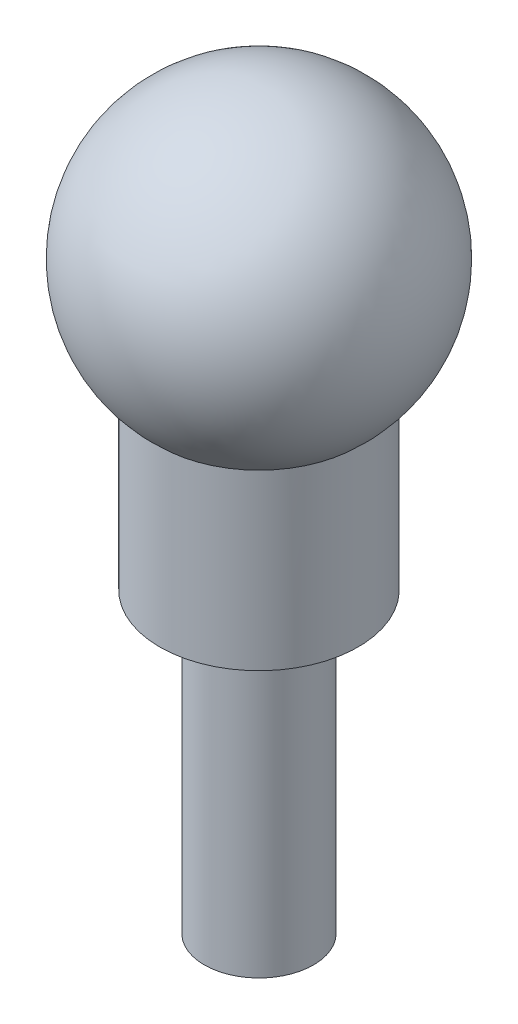
ISO-10303-21;
HEADER;
FILE_DESCRIPTION(('STEP AP214'),'2;1');
FILE_NAME('part.step','',(''),(''),'','','');
FILE_SCHEMA(('AUTOMOTIVE_DESIGN { 1 0 10303 214 1 1 1 1 }'));
ENDSEC;
DATA;
#1=APPLICATION_CONTEXT('core data for automotive mechanical design processes');
#2=APPLICATION_PROTOCOL_DEFINITION('international standard','automotive_design',2000,#1);
#3=PRODUCT_CONTEXT('',#1,'mechanical');
#4=PRODUCT('Part','Part','',(#3));
#5=PRODUCT_RELATED_PRODUCT_CATEGORY('part','',(#4));
#6=PRODUCT_DEFINITION_FORMATION('','',#4);
#7=PRODUCT_DEFINITION_CONTEXT('part definition',#1,'design');
#8=PRODUCT_DEFINITION('design','',#6,#7);
#9=PRODUCT_DEFINITION_SHAPE('','',#8);
#10=(LENGTH_UNIT() NAMED_UNIT(*) SI_UNIT(.MILLI.,.METRE.));
#11=(NAMED_UNIT(*) PLANE_ANGLE_UNIT() SI_UNIT($,.RADIAN.));
#12=(NAMED_UNIT(*) SI_UNIT($,.STERADIAN.) SOLID_ANGLE_UNIT());
#13=UNCERTAINTY_MEASURE_WITH_UNIT(LENGTH_MEASURE(1.E-05),#10,'distance_accuracy_value','');
#14=(GEOMETRIC_REPRESENTATION_CONTEXT(3) GLOBAL_UNCERTAINTY_ASSIGNED_CONTEXT((#13)) GLOBAL_UNIT_ASSIGNED_CONTEXT((#10,
#11,#12)) REPRESENTATION_CONTEXT('',''));
#15=CARTESIAN_POINT('',(0.,0.,0.));
#16=DIRECTION('',(0.,0.,1.));
#17=DIRECTION('',(1.,0.,0.));
#18=AXIS2_PLACEMENT_3D('',#15,#16,#17);
#19=CARTESIAN_POINT('',(0.,12.,0.));
#20=DIRECTION('',(0.,-1.,0.));
#21=DIRECTION('',(0.,0.,-1.));
#22=AXIS2_PLACEMENT_3D('',#19,#20,#21);
#23=CYLINDRICAL_SURFACE('',#22,2.2);
#24=CARTESIAN_POINT('',(0.,12.,0.));
#25=DIRECTION('',(0.,1.,0.));
#26=DIRECTION('',(0.,0.,1.));
#27=AXIS2_PLACEMENT_3D('',#24,#25,#26);
#28=CIRCLE('',#27,2.2);
#29=CARTESIAN_POINT('',(0.,12.,2.2));
#30=VERTEX_POINT('',#29);
#31=EDGE_CURVE('E10',#30,#30,#28,.T.);
#32=ORIENTED_EDGE('',*,*,#31,.F.);
#33=EDGE_LOOP('',(#32));
#34=FACE_BOUND('',#33,.T.);
#35=CARTESIAN_POINT('',(0.,0.,0.));
#36=DIRECTION('',(0.,1.,0.));
#37=DIRECTION('',(0.,0.,1.));
#38=AXIS2_PLACEMENT_3D('',#35,#36,#37);
#39=CIRCLE('',#38,2.2);
#40=CARTESIAN_POINT('',(0.,0.,2.2));
#41=VERTEX_POINT('',#40);
#42=EDGE_CURVE('E37',#41,#41,#39,.T.);
#43=ORIENTED_EDGE('',*,*,#42,.T.);
#44=EDGE_LOOP('',(#43));
#45=FACE_BOUND('',#44,.T.);
#46=ADVANCED_FACE('F34',(#34,#45),#23,.T.);
#47=CARTESIAN_POINT('',(0.,0.,0.));
#48=DIRECTION('',(0.,1.,0.));
#49=DIRECTION('',(0.,0.,1.));
#50=AXIS2_PLACEMENT_3D('',#47,#48,#49);
#51=PLANE('',#50);
#52=ORIENTED_EDGE('',*,*,#42,.F.);
#53=EDGE_LOOP('',(#52));
#54=FACE_BOUND('',#53,.T.);
#55=ADVANCED_FACE('F58',(#54),#51,.F.);
#56=CARTESIAN_POINT('',(0.,19.,0.));
#57=DIRECTION('',(0.,-1.,0.));
#58=DIRECTION('',(0.,0.,-1.));
#59=AXIS2_PLACEMENT_3D('',#56,#57,#58);
#60=CYLINDRICAL_SURFACE('',#59,4.);
#61=CARTESIAN_POINT('',(0.,19.,0.));
#62=DIRECTION('',(0.,1.,0.));
#63=DIRECTION('',(0.,0.,1.));
#64=AXIS2_PLACEMENT_3D('',#61,#62,#63);
#65=CIRCLE('',#64,4.);
#66=CARTESIAN_POINT('',(0.,19.,4.));
#67=VERTEX_POINT('',#66);
#68=EDGE_CURVE('E44',#67,#67,#65,.T.);
#69=ORIENTED_EDGE('',*,*,#68,.F.);
#70=EDGE_LOOP('',(#69));
#71=FACE_BOUND('',#70,.T.);
#72=CARTESIAN_POINT('',(0.,12.,0.));
#73=DIRECTION('',(0.,1.,0.));
#74=DIRECTION('',(0.,0.,1.));
#75=AXIS2_PLACEMENT_3D('',#72,#73,#74);
#76=CIRCLE('',#75,4.);
#77=CARTESIAN_POINT('',(0.,12.,4.));
#78=VERTEX_POINT('',#77);
#79=EDGE_CURVE('E46',#78,#78,#76,.T.);
#80=ORIENTED_EDGE('',*,*,#79,.T.);
#81=EDGE_LOOP('',(#80));
#82=FACE_BOUND('',#81,.T.);
#83=ADVANCED_FACE('F54',(#71,#82),#60,.T.);
#84=CARTESIAN_POINT('',(0.,12.,0.));
#85=DIRECTION('',(0.,1.,0.));
#86=DIRECTION('',(0.,0.,1.));
#87=AXIS2_PLACEMENT_3D('',#84,#85,#86);
#88=PLANE('',#87);
#89=ORIENTED_EDGE('',*,*,#31,.T.);
#90=EDGE_LOOP('',(#89));
#91=FACE_BOUND('',#90,.T.);
#92=ORIENTED_EDGE('',*,*,#79,.F.);
#93=EDGE_LOOP('',(#92));
#94=FACE_BOUND('',#93,.T.);
#95=ADVANCED_FACE('F57',(#91,#94),#88,.F.);
#96=CARTESIAN_POINT('',(0.,23.5596930851488,0.));
#97=DIRECTION('',(0.,1.,0.));
#98=DIRECTION('',(1.,0.,0.));
#99=AXIS2_PLACEMENT_3D('',#96,#97,#98);
#100=SPHERICAL_SURFACE('',#99,6.06554210526593);
#101=ORIENTED_EDGE('',*,*,#68,.T.);
#102=EDGE_LOOP('',(#101));
#103=FACE_BOUND('',#102,.T.);
#104=ADVANCED_FACE('F52',(#103),#100,.T.);
#105=CLOSED_SHELL('',(#46,#55,#83,#95,#104));
#106=MANIFOLD_SOLID_BREP('B2',#105);
#107=ADVANCED_BREP_SHAPE_REPRESENTATION('',(#18,#106),#14);
#108=SHAPE_DEFINITION_REPRESENTATION(#9,#107);
ENDSEC;
END-ISO-10303-21;
